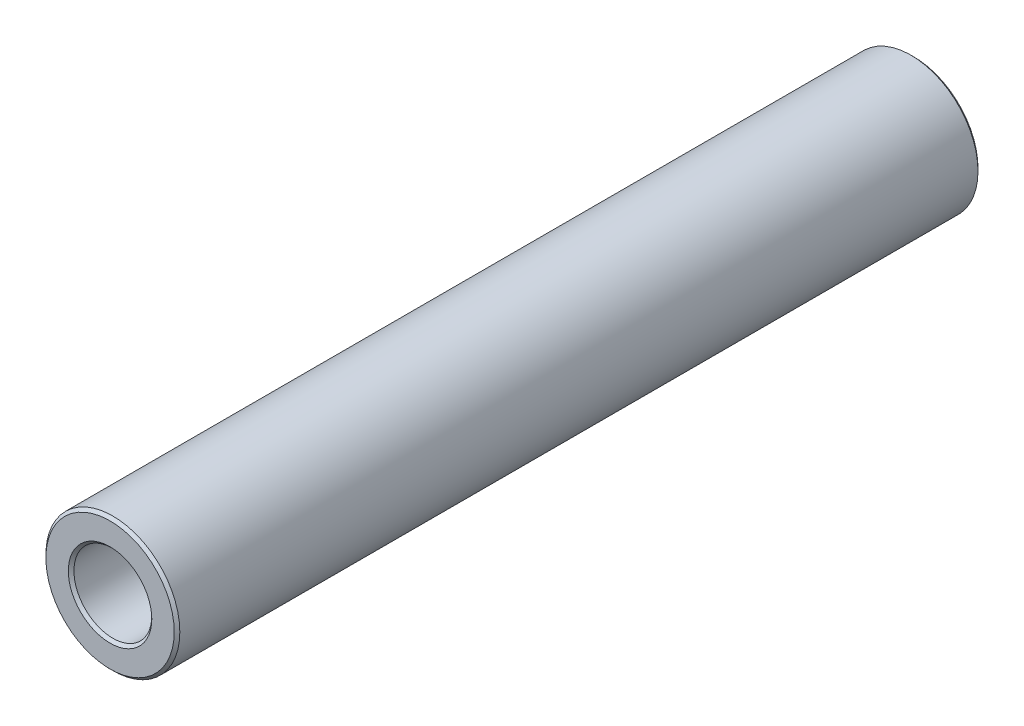
ISO-10303-21;
HEADER;
FILE_DESCRIPTION(('STEP AP214'),'2;1');
FILE_NAME('part.step','',(''),(''),'','','');
FILE_SCHEMA(('AUTOMOTIVE_DESIGN { 1 0 10303 214 1 1 1 1 }'));
ENDSEC;
DATA;
#1=APPLICATION_CONTEXT('core data for automotive mechanical design processes');
#2=APPLICATION_PROTOCOL_DEFINITION('international standard','automotive_design',2000,#1);
#3=PRODUCT_CONTEXT('',#1,'mechanical');
#4=PRODUCT('Part','Part','',(#3));
#5=PRODUCT_RELATED_PRODUCT_CATEGORY('part','',(#4));
#6=PRODUCT_DEFINITION_FORMATION('','',#4);
#7=PRODUCT_DEFINITION_CONTEXT('part definition',#1,'design');
#8=PRODUCT_DEFINITION('design','',#6,#7);
#9=PRODUCT_DEFINITION_SHAPE('','',#8);
#10=(LENGTH_UNIT() NAMED_UNIT(*) SI_UNIT(.MILLI.,.METRE.));
#11=(NAMED_UNIT(*) PLANE_ANGLE_UNIT() SI_UNIT($,.RADIAN.));
#12=(NAMED_UNIT(*) SI_UNIT($,.STERADIAN.) SOLID_ANGLE_UNIT());
#13=UNCERTAINTY_MEASURE_WITH_UNIT(LENGTH_MEASURE(1.E-05),#10,'distance_accuracy_value','');
#14=(GEOMETRIC_REPRESENTATION_CONTEXT(3) GLOBAL_UNCERTAINTY_ASSIGNED_CONTEXT((#13)) GLOBAL_UNIT_ASSIGNED_CONTEXT((#10,
#11,#12)) REPRESENTATION_CONTEXT('',''));
#15=CARTESIAN_POINT('',(0.,0.,0.));
#16=DIRECTION('',(0.,0.,1.));
#17=DIRECTION('',(1.,0.,0.));
#18=AXIS2_PLACEMENT_3D('',#15,#16,#17);
#19=CARTESIAN_POINT('',(0.,0.,-28.575));
#20=DIRECTION('',(0.,0.,1.));
#21=DIRECTION('',(1.,0.,0.));
#22=AXIS2_PLACEMENT_3D('',#19,#20,#21);
#23=CYLINDRICAL_SURFACE('',#22,4.7625);
#24=CARTESIAN_POINT('',(0.,0.,28.37561));
#25=DIRECTION('',(0.,0.,1.));
#26=DIRECTION('',(1.,0.,0.));
#27=AXIS2_PLACEMENT_3D('',#24,#25,#26);
#28=CIRCLE('',#27,4.7625);
#29=CARTESIAN_POINT('',(4.7625,0.,28.37561));
#30=VERTEX_POINT('',#29);
#31=EDGE_CURVE('E69',#30,#30,#28,.F.);
#32=CARTESIAN_POINT('',(0.,0.,-28.37561));
#33=DIRECTION('',(0.,0.,1.));
#34=DIRECTION('',(1.,0.,0.));
#35=AXIS2_PLACEMENT_3D('',#32,#33,#34);
#36=CIRCLE('',#35,4.7625);
#37=CARTESIAN_POINT('',(4.7625,0.,-28.37561));
#38=VERTEX_POINT('',#37);
#39=EDGE_CURVE('E73',#38,#38,#36,.T.);
#40=CARTESIAN_POINT('',(4.7625,0.,28.37561));
#41=CARTESIAN_POINT('',(4.7625,0.,27.7844514583333));
#42=CARTESIAN_POINT('',(4.7625,0.,27.1932929166667));
#43=CARTESIAN_POINT('',(4.7625,0.,26.0109758333333));
#44=CARTESIAN_POINT('',(4.7625,0.,25.4198172916667));
#45=CARTESIAN_POINT('',(4.7625,0.,24.2375002083333));
#46=CARTESIAN_POINT('',(4.7625,0.,23.6463416666667));
#47=CARTESIAN_POINT('',(4.7625,0.,22.4640245833333));
#48=CARTESIAN_POINT('',(4.7625,0.,21.8728660416667));
#49=CARTESIAN_POINT('',(4.7625,0.,20.6905489583333));
#50=CARTESIAN_POINT('',(4.7625,0.,20.0993904166667));
#51=CARTESIAN_POINT('',(4.7625,0.,18.9170733333333));
#52=CARTESIAN_POINT('',(4.7625,0.,18.3259147916667));
#53=CARTESIAN_POINT('',(4.7625,0.,17.1435977083333));
#54=CARTESIAN_POINT('',(4.7625,0.,16.5524391666667));
#55=CARTESIAN_POINT('',(4.7625,0.,15.3701220833333));
#56=CARTESIAN_POINT('',(4.7625,0.,14.7789635416667));
#57=CARTESIAN_POINT('',(4.7625,0.,13.5966464583333));
#58=CARTESIAN_POINT('',(4.7625,0.,13.0054879166667));
#59=CARTESIAN_POINT('',(4.7625,0.,11.8231708333333));
#60=CARTESIAN_POINT('',(4.7625,0.,11.2320122916667));
#61=CARTESIAN_POINT('',(4.7625,0.,10.0496952083333));
#62=CARTESIAN_POINT('',(4.7625,0.,9.45853666666668));
#63=CARTESIAN_POINT('',(4.7625,0.,8.27621958333335));
#64=CARTESIAN_POINT('',(4.7625,0.,7.68506104166668));
#65=CARTESIAN_POINT('',(4.7625,0.,6.50274395833335));
#66=CARTESIAN_POINT('',(4.7625,0.,5.91158541666668));
#67=CARTESIAN_POINT('',(4.7625,0.,4.72926833333335));
#68=CARTESIAN_POINT('',(4.7625,0.,4.13810979166668));
#69=CARTESIAN_POINT('',(4.7625,0.,2.95579270833335));
#70=CARTESIAN_POINT('',(4.7625,0.,2.36463416666668));
#71=CARTESIAN_POINT('',(4.7625,0.,1.18231708333335));
#72=CARTESIAN_POINT('',(4.7625,0.,0.591158541666684));
#73=CARTESIAN_POINT('',(4.7625,0.,-0.591158541666649));
#74=CARTESIAN_POINT('',(4.7625,0.,-1.18231708333332));
#75=CARTESIAN_POINT('',(4.7625,0.,-2.36463416666665));
#76=CARTESIAN_POINT('',(4.7625,0.,-2.95579270833332));
#77=CARTESIAN_POINT('',(4.7625,0.,-4.13810979166665));
#78=CARTESIAN_POINT('',(4.7625,0.,-4.72926833333331));
#79=CARTESIAN_POINT('',(4.7625,0.,-5.91158541666665));
#80=CARTESIAN_POINT('',(4.7625,0.,-6.50274395833332));
#81=CARTESIAN_POINT('',(4.7625,0.,-7.68506104166665));
#82=CARTESIAN_POINT('',(4.7625,0.,-8.27621958333332));
#83=CARTESIAN_POINT('',(4.7625,0.,-9.45853666666665));
#84=CARTESIAN_POINT('',(4.7625,0.,-10.0496952083333));
#85=CARTESIAN_POINT('',(4.7625,0.,-11.2320122916666));
#86=CARTESIAN_POINT('',(4.7625,0.,-11.8231708333333));
#87=CARTESIAN_POINT('',(4.7625,0.,-13.0054879166666));
#88=CARTESIAN_POINT('',(4.7625,0.,-13.5966464583333));
#89=CARTESIAN_POINT('',(4.7625,0.,-14.7789635416666));
#90=CARTESIAN_POINT('',(4.7625,0.,-15.3701220833333));
#91=CARTESIAN_POINT('',(4.7625,0.,-16.5524391666666));
#92=CARTESIAN_POINT('',(4.7625,0.,-17.1435977083333));
#93=CARTESIAN_POINT('',(4.7625,0.,-18.3259147916666));
#94=CARTESIAN_POINT('',(4.7625,0.,-18.9170733333333));
#95=CARTESIAN_POINT('',(4.7625,0.,-20.0993904166666));
#96=CARTESIAN_POINT('',(4.7625,0.,-20.6905489583333));
#97=CARTESIAN_POINT('',(4.7625,0.,-21.8728660416666));
#98=CARTESIAN_POINT('',(4.7625,0.,-22.4640245833333));
#99=CARTESIAN_POINT('',(4.7625,0.,-23.6463416666666));
#100=CARTESIAN_POINT('',(4.7625,0.,-24.2375002083333));
#101=CARTESIAN_POINT('',(4.7625,0.,-25.4198172916666));
#102=CARTESIAN_POINT('',(4.7625,0.,-26.0109758333333));
#103=CARTESIAN_POINT('',(4.7625,0.,-27.1932929166666));
#104=CARTESIAN_POINT('',(4.7625,0.,-27.7844514583333));
#105=CARTESIAN_POINT('',(4.7625,0.,-28.37561));
#106=B_SPLINE_CURVE_WITH_KNOTS('',3,(#40,#41,#42,#43,#44,#45,#46,#47,#48,#49,#50,#51,#52,#53,
#54,#55,#56,#57,#58,#59,#60,#61,#62,#63,#64,#65,#66,#67,#68,#69,#70,#71,#72,#73,#74,#75,#76,#77,
#78,#79,#80,#81,#82,#83,#84,#85,#86,#87,#88,#89,#90,#91,#92,#93,#94,#95,#96,#97,#98,#99,#100,
#101,#102,#103,#104,#105),.UNSPECIFIED.,.F.,.F.,(4,2,2,2,2,2,2,2,2,2,2,2,2,2,2,2,2,2,2,2,2,2,2,
2,2,2,2,2,2,2,2,2,4),(0.,1.773475625,3.54695125,5.320426875,7.0939025,8.867378125,10.64085375,
12.414329375,14.187805,15.961280625,17.73475625,19.508231875,21.2817075,23.055183125,
24.82865875,26.602134375,28.37561,30.149085625,31.92256125,33.696036875,35.4695125,37.242988125,
39.01646375,40.789939375,42.563415,44.336890625,46.11036625,47.883841875,49.6573175,
51.430793125,53.20426875,54.977744375,56.75122),.UNSPECIFIED.);
#107=EDGE_CURVE('BSEAM43',#30,#38,#106,.T.);
#108=ORIENTED_EDGE('',*,*,#31,.T.);
#109=ORIENTED_EDGE('',*,*,#39,.T.);
#110=ORIENTED_EDGE('',*,*,#107,.T.);
#111=ORIENTED_EDGE('',*,*,#107,.F.);
#112=EDGE_LOOP('',(#108,#110,#109,#111));
#113=FACE_BOUND('',#112,.T.);
#114=ADVANCED_FACE('F43',(#113),#23,.T.);
#115=CARTESIAN_POINT('',(0.,0.,-28.575));
#116=DIRECTION('',(0.,0.,1.));
#117=DIRECTION('',(1.,0.,0.));
#118=AXIS2_PLACEMENT_3D('',#115,#116,#117);
#119=PLANE('',#118);
#120=CARTESIAN_POINT('',(0.,0.,-28.575));
#121=DIRECTION('',(0.,0.,1.));
#122=DIRECTION('',(1.,0.,0.));
#123=AXIS2_PLACEMENT_3D('',#120,#121,#122);
#124=CIRCLE('',#123,4.56310999999997);
#125=CARTESIAN_POINT('',(4.56310999999997,0.,-28.575));
#126=VERTEX_POINT('',#125);
#127=EDGE_CURVE('E57',#126,#126,#124,.F.);
#128=ORIENTED_EDGE('',*,*,#127,.T.);
#129=EDGE_LOOP('',(#128));
#130=FACE_BOUND('',#129,.T.);
#131=CARTESIAN_POINT('',(0.,0.,-28.575));
#132=DIRECTION('',(0.,0.,1.));
#133=DIRECTION('',(1.,0.,0.));
#134=AXIS2_PLACEMENT_3D('',#131,#132,#133);
#135=CIRCLE('',#134,2.96798999999997);
#136=CARTESIAN_POINT('',(2.96798999999997,0.,-28.575));
#137=VERTEX_POINT('',#136);
#138=EDGE_CURVE('E63',#137,#137,#135,.T.);
#139=ORIENTED_EDGE('',*,*,#138,.T.);
#140=EDGE_LOOP('',(#139));
#141=FACE_BOUND('',#140,.T.);
#142=ADVANCED_FACE('F102',(#130,#141),#119,.F.);
#143=CARTESIAN_POINT('',(0.,0.,-28.575));
#144=DIRECTION('',(0.,0.,1.));
#145=DIRECTION('',(1.,0.,0.));
#146=AXIS2_PLACEMENT_3D('',#143,#144,#145);
#147=CYLINDRICAL_SURFACE('',#146,2.7686);
#148=CARTESIAN_POINT('',(0.,0.,28.37561));
#149=DIRECTION('',(0.,0.,1.));
#150=DIRECTION('',(1.,0.,0.));
#151=AXIS2_PLACEMENT_3D('',#148,#149,#150);
#152=CIRCLE('',#151,2.7686);
#153=CARTESIAN_POINT('',(2.7686,0.,28.37561));
#154=VERTEX_POINT('',#153);
#155=EDGE_CURVE('E10',#154,#154,#152,.T.);
#156=CARTESIAN_POINT('',(0.,0.,-28.37561));
#157=DIRECTION('',(0.,0.,1.));
#158=DIRECTION('',(1.,0.,0.));
#159=AXIS2_PLACEMENT_3D('',#156,#157,#158);
#160=CIRCLE('',#159,2.7686);
#161=CARTESIAN_POINT('',(2.7686,0.,-28.37561));
#162=VERTEX_POINT('',#161);
#163=EDGE_CURVE('E51',#162,#162,#160,.F.);
#164=CARTESIAN_POINT('',(2.7686,0.,28.37561));
#165=CARTESIAN_POINT('',(2.7686,0.,27.7844514583333));
#166=CARTESIAN_POINT('',(2.7686,0.,27.1932929166666));
#167=CARTESIAN_POINT('',(2.7686,0.,26.0109758333333));
#168=CARTESIAN_POINT('',(2.7686,0.,25.4198172916666));
#169=CARTESIAN_POINT('',(2.7686,0.,24.2375002083333));
#170=CARTESIAN_POINT('',(2.7686,0.,23.6463416666666));
#171=CARTESIAN_POINT('',(2.7686,0.,22.4640245833333));
#172=CARTESIAN_POINT('',(2.7686,0.,21.8728660416666));
#173=CARTESIAN_POINT('',(2.7686,0.,20.6905489583333));
#174=CARTESIAN_POINT('',(2.7686,0.,20.0993904166666));
#175=CARTESIAN_POINT('',(2.7686,0.,18.9170733333333));
#176=CARTESIAN_POINT('',(2.7686,0.,18.3259147916666));
#177=CARTESIAN_POINT('',(2.7686,0.,17.1435977083333));
#178=CARTESIAN_POINT('',(2.7686,0.,16.5524391666666));
#179=CARTESIAN_POINT('',(2.7686,0.,15.3701220833333));
#180=CARTESIAN_POINT('',(2.7686,0.,14.7789635416666));
#181=CARTESIAN_POINT('',(2.7686,0.,13.5966464583333));
#182=CARTESIAN_POINT('',(2.7686,0.,13.0054879166666));
#183=CARTESIAN_POINT('',(2.7686,0.,11.8231708333333));
#184=CARTESIAN_POINT('',(2.7686,0.,11.2320122916666));
#185=CARTESIAN_POINT('',(2.7686,0.,10.0496952083333));
#186=CARTESIAN_POINT('',(2.7686,0.,9.45853666666664));
#187=CARTESIAN_POINT('',(2.7686,0.,8.2762195833333));
#188=CARTESIAN_POINT('',(2.7686,0.,7.68506104166664));
#189=CARTESIAN_POINT('',(2.7686,0.,6.5027439583333));
#190=CARTESIAN_POINT('',(2.7686,0.,5.91158541666664));
#191=CARTESIAN_POINT('',(2.7686,0.,4.7292683333333));
#192=CARTESIAN_POINT('',(2.7686,0.,4.13810979166663));
#193=CARTESIAN_POINT('',(2.7686,0.,2.9557927083333));
#194=CARTESIAN_POINT('',(2.7686,0.,2.36463416666664));
#195=CARTESIAN_POINT('',(2.7686,0.,1.18231708333331));
#196=CARTESIAN_POINT('',(2.7686,0.,0.591158541666639));
#197=CARTESIAN_POINT('',(2.7686,0.,-0.591158541666694));
#198=CARTESIAN_POINT('',(2.7686,0.,-1.18231708333336));
#199=CARTESIAN_POINT('',(2.7686,0.,-2.3646341666667));
#200=CARTESIAN_POINT('',(2.7686,0.,-2.95579270833336));
#201=CARTESIAN_POINT('',(2.7686,0.,-4.1381097916667));
#202=CARTESIAN_POINT('',(2.7686,0.,-4.72926833333336));
#203=CARTESIAN_POINT('',(2.7686,0.,-5.9115854166667));
#204=CARTESIAN_POINT('',(2.7686,0.,-6.50274395833336));
#205=CARTESIAN_POINT('',(2.7686,0.,-7.6850610416667));
#206=CARTESIAN_POINT('',(2.7686,0.,-8.27621958333336));
#207=CARTESIAN_POINT('',(2.7686,0.,-9.4585366666667));
#208=CARTESIAN_POINT('',(2.7686,0.,-10.0496952083334));
#209=CARTESIAN_POINT('',(2.7686,0.,-11.2320122916667));
#210=CARTESIAN_POINT('',(2.7686,0.,-11.8231708333334));
#211=CARTESIAN_POINT('',(2.7686,0.,-13.0054879166667));
#212=CARTESIAN_POINT('',(2.7686,0.,-13.5966464583334));
#213=CARTESIAN_POINT('',(2.7686,0.,-14.7789635416667));
#214=CARTESIAN_POINT('',(2.7686,0.,-15.3701220833334));
#215=CARTESIAN_POINT('',(2.7686,0.,-16.5524391666667));
#216=CARTESIAN_POINT('',(2.7686,0.,-17.1435977083334));
#217=CARTESIAN_POINT('',(2.7686,0.,-18.3259147916667));
#218=CARTESIAN_POINT('',(2.7686,0.,-18.9170733333334));
#219=CARTESIAN_POINT('',(2.7686,0.,-20.0993904166667));
#220=CARTESIAN_POINT('',(2.7686,0.,-20.6905489583334));
#221=CARTESIAN_POINT('',(2.7686,0.,-21.8728660416667));
#222=CARTESIAN_POINT('',(2.7686,0.,-22.4640245833334));
#223=CARTESIAN_POINT('',(2.7686,0.,-23.6463416666667));
#224=CARTESIAN_POINT('',(2.7686,0.,-24.2375002083334));
#225=CARTESIAN_POINT('',(2.7686,0.,-25.4198172916667));
#226=CARTESIAN_POINT('',(2.7686,0.,-26.0109758333334));
#227=CARTESIAN_POINT('',(2.7686,0.,-27.1932929166667));
#228=CARTESIAN_POINT('',(2.7686,0.,-27.7844514583334));
#229=CARTESIAN_POINT('',(2.7686,0.,-28.37561));
#230=B_SPLINE_CURVE_WITH_KNOTS('',3,(#164,#165,#166,#167,#168,#169,#170,#171,#172,#173,#174,
#175,#176,#177,#178,#179,#180,#181,#182,#183,#184,#185,#186,#187,#188,#189,#190,#191,#192,#193,
#194,#195,#196,#197,#198,#199,#200,#201,#202,#203,#204,#205,#206,#207,#208,#209,#210,#211,#212,
#213,#214,#215,#216,#217,#218,#219,#220,#221,#222,#223,#224,#225,#226,#227,#228,#229),
.UNSPECIFIED.,.F.,.F.,(4,2,2,2,2,2,2,2,2,2,2,2,2,2,2,2,2,2,2,2,2,2,2,2,2,2,2,2,2,2,2,2,4),(0.,
1.773475625,3.54695125,5.320426875,7.0939025,8.86737812500001,10.64085375,12.414329375,
14.187805,15.961280625,17.73475625,19.508231875,21.2817075,23.055183125,24.82865875,
26.602134375,28.37561,30.149085625,31.92256125,33.696036875,35.4695125,37.242988125,39.01646375,
40.789939375,42.563415,44.336890625,46.11036625,47.883841875,49.6573175,51.430793125,
53.20426875,54.977744375,56.75122),.UNSPECIFIED.);
#231=EDGE_CURVE('BSEAM108',#154,#162,#230,.T.);
#232=ORIENTED_EDGE('',*,*,#155,.T.);
#233=ORIENTED_EDGE('',*,*,#163,.T.);
#234=ORIENTED_EDGE('',*,*,#231,.T.);
#235=ORIENTED_EDGE('',*,*,#231,.F.);
#236=EDGE_LOOP('',(#232,#234,#233,#235));
#237=FACE_BOUND('',#236,.T.);
#238=ADVANCED_FACE('F108',(#237),#147,.F.);
#239=CARTESIAN_POINT('',(0.,0.,28.575));
#240=DIRECTION('',(0.,0.,1.));
#241=DIRECTION('',(1.,0.,0.));
#242=AXIS2_PLACEMENT_3D('',#239,#240,#241);
#243=PLANE('',#242);
#244=CARTESIAN_POINT('',(0.,0.,28.575));
#245=DIRECTION('',(0.,0.,1.));
#246=DIRECTION('',(1.,0.,0.));
#247=AXIS2_PLACEMENT_3D('',#244,#245,#246);
#248=CIRCLE('',#247,4.56311000000001);
#249=CARTESIAN_POINT('',(4.56311000000001,0.,28.575));
#250=VERTEX_POINT('',#249);
#251=EDGE_CURVE('E77',#250,#250,#248,.T.);
#252=ORIENTED_EDGE('',*,*,#251,.T.);
#253=EDGE_LOOP('',(#252));
#254=FACE_BOUND('',#253,.T.);
#255=CARTESIAN_POINT('',(0.,0.,28.575));
#256=DIRECTION('',(0.,0.,1.));
#257=DIRECTION('',(1.,0.,0.));
#258=AXIS2_PLACEMENT_3D('',#255,#256,#257);
#259=CIRCLE('',#258,2.96799000000002);
#260=CARTESIAN_POINT('',(2.96799000000002,0.,28.575));
#261=VERTEX_POINT('',#260);
#262=EDGE_CURVE('E81',#261,#261,#259,.F.);
#263=ORIENTED_EDGE('',*,*,#262,.T.);
#264=EDGE_LOOP('',(#263));
#265=FACE_BOUND('',#264,.T.);
#266=ADVANCED_FACE('F87',(#254,#265),#243,.T.);
#267=CARTESIAN_POINT('',(0.,0.,28.575));
#268=DIRECTION('',(0.,0.,-1.));
#269=DIRECTION('',(-1.,0.,0.));
#270=AXIS2_PLACEMENT_3D('',#267,#268,#269);
#271=CONICAL_SURFACE('',#270,4.56311000000001,0.785398163397444);
#272=ORIENTED_EDGE('',*,*,#31,.F.);
#273=EDGE_LOOP('',(#272));
#274=FACE_BOUND('',#273,.T.);
#275=ORIENTED_EDGE('',*,*,#251,.F.);
#276=EDGE_LOOP('',(#275));
#277=FACE_BOUND('',#276,.T.);
#278=ADVANCED_FACE('F98',(#274,#277),#271,.T.);
#279=CARTESIAN_POINT('',(0.,0.,-28.37561));
#280=DIRECTION('',(0.,0.,1.));
#281=DIRECTION('',(1.,0.,0.));
#282=AXIS2_PLACEMENT_3D('',#279,#280,#281);
#283=CONICAL_SURFACE('',#282,4.7625,0.785398163397444);
#284=ORIENTED_EDGE('',*,*,#127,.F.);
#285=EDGE_LOOP('',(#284));
#286=FACE_BOUND('',#285,.T.);
#287=ORIENTED_EDGE('',*,*,#39,.F.);
#288=EDGE_LOOP('',(#287));
#289=FACE_BOUND('',#288,.T.);
#290=ADVANCED_FACE('F92',(#286,#289),#283,.T.);
#291=CARTESIAN_POINT('',(0.,0.,28.37561));
#292=DIRECTION('',(0.,0.,1.));
#293=DIRECTION('',(1.,0.,0.));
#294=AXIS2_PLACEMENT_3D('',#291,#292,#293);
#295=CONICAL_SURFACE('',#294,2.7686,0.785398163397455);
#296=ORIENTED_EDGE('',*,*,#262,.F.);
#297=EDGE_LOOP('',(#296));
#298=FACE_BOUND('',#297,.T.);
#299=ORIENTED_EDGE('',*,*,#155,.F.);
#300=EDGE_LOOP('',(#299));
#301=FACE_BOUND('',#300,.T.);
#302=ADVANCED_FACE('F89',(#298,#301),#295,.F.);
#303=CARTESIAN_POINT('',(0.,0.,-28.575));
#304=DIRECTION('',(0.,0.,-1.));
#305=DIRECTION('',(-1.,0.,0.));
#306=AXIS2_PLACEMENT_3D('',#303,#304,#305);
#307=CONICAL_SURFACE('',#306,2.96798999999997,0.785398163397437);
#308=ORIENTED_EDGE('',*,*,#163,.F.);
#309=EDGE_LOOP('',(#308));
#310=FACE_BOUND('',#309,.T.);
#311=ORIENTED_EDGE('',*,*,#138,.F.);
#312=EDGE_LOOP('',(#311));
#313=FACE_BOUND('',#312,.T.);
#314=ADVANCED_FACE('F45',(#310,#313),#307,.F.);
#315=CLOSED_SHELL('',(#114,#142,#238,#266,#278,#290,#302,#314));
#316=MANIFOLD_SOLID_BREP('B2',#315);
#317=ADVANCED_BREP_SHAPE_REPRESENTATION('',(#18,#316),#14);
#318=SHAPE_DEFINITION_REPRESENTATION(#9,#317);
ENDSEC;
END-ISO-10303-21;
